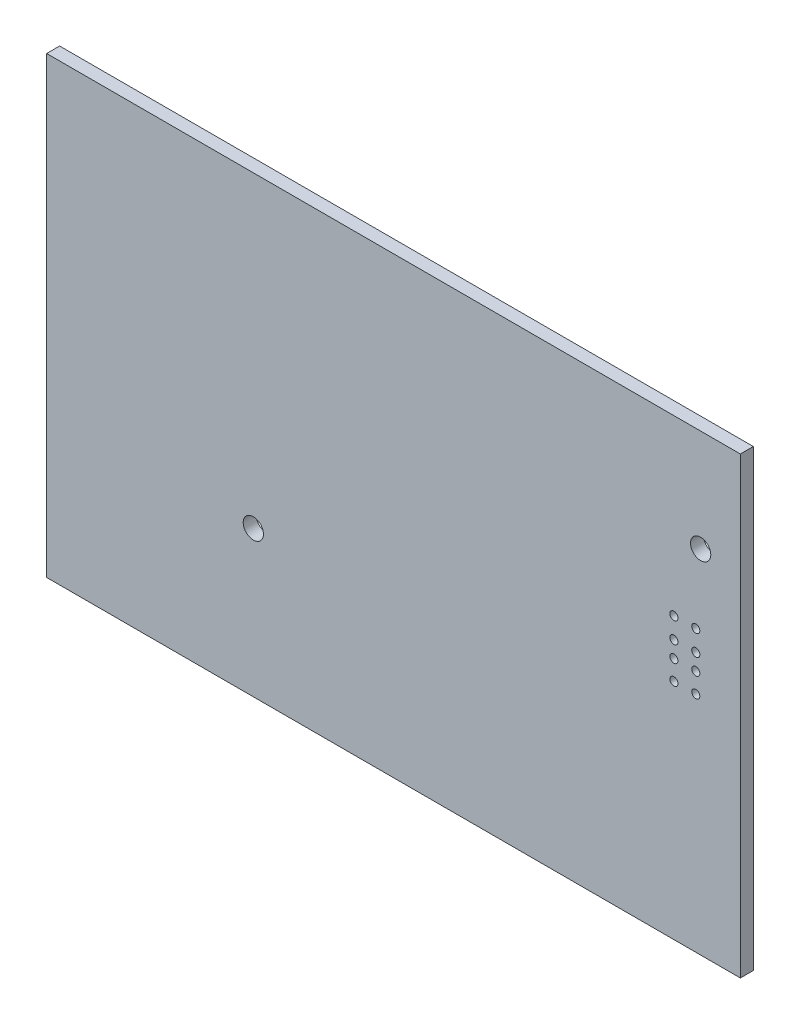
ISO-10303-21;
HEADER;
FILE_DESCRIPTION(('STEP AP214'),'2;1');
FILE_NAME('part.step','',(''),(''),'','','');
FILE_SCHEMA(('AUTOMOTIVE_DESIGN { 1 0 10303 214 1 1 1 1 }'));
ENDSEC;
DATA;
#1=APPLICATION_CONTEXT('core data for automotive mechanical design processes');
#2=APPLICATION_PROTOCOL_DEFINITION('international standard','automotive_design',2000,#1);
#3=PRODUCT_CONTEXT('',#1,'mechanical');
#4=PRODUCT('Part','Part','',(#3));
#5=PRODUCT_RELATED_PRODUCT_CATEGORY('part','',(#4));
#6=PRODUCT_DEFINITION_FORMATION('','',#4);
#7=PRODUCT_DEFINITION_CONTEXT('part definition',#1,'design');
#8=PRODUCT_DEFINITION('design','',#6,#7);
#9=PRODUCT_DEFINITION_SHAPE('','',#8);
#10=(LENGTH_UNIT() NAMED_UNIT(*) SI_UNIT(.MILLI.,.METRE.));
#11=(NAMED_UNIT(*) PLANE_ANGLE_UNIT() SI_UNIT($,.RADIAN.));
#12=(NAMED_UNIT(*) SI_UNIT($,.STERADIAN.) SOLID_ANGLE_UNIT());
#13=UNCERTAINTY_MEASURE_WITH_UNIT(LENGTH_MEASURE(1.E-05),#10,'distance_accuracy_value','');
#14=(GEOMETRIC_REPRESENTATION_CONTEXT(3) GLOBAL_UNCERTAINTY_ASSIGNED_CONTEXT((#13)) GLOBAL_UNIT_ASSIGNED_CONTEXT((#10,
#11,#12)) REPRESENTATION_CONTEXT('',''));
#15=CARTESIAN_POINT('',(0.,0.,0.));
#16=DIRECTION('',(0.,0.,1.));
#17=DIRECTION('',(1.,0.,0.));
#18=AXIS2_PLACEMENT_3D('',#15,#16,#17);
#19=CARTESIAN_POINT('',(-43.1,28.,1.6));
#20=DIRECTION('',(0.,1.,0.));
#21=DIRECTION('',(-1.,0.,0.));
#22=AXIS2_PLACEMENT_3D('',#19,#20,#21);
#23=PLANE('',#22);
#24=DIRECTION('',(1.,0.,0.));
#25=VECTOR('',#24,1.);
#26=CARTESIAN_POINT('',(-43.1,28.,0.));
#27=LINE('',#26,#25);
#28=CARTESIAN_POINT('',(-43.1,28.,0.));
#29=VERTEX_POINT('',#28);
#30=CARTESIAN_POINT('',(42.5,28.,0.));
#31=VERTEX_POINT('',#30);
#32=EDGE_CURVE('E103',#29,#31,#27,.T.);
#33=ORIENTED_EDGE('',*,*,#32,.F.);
#34=DIRECTION('',(0.,0.,-1.));
#35=VECTOR('',#34,1.);
#36=CARTESIAN_POINT('',(-43.1,28.,1.6));
#37=LINE('',#36,#35);
#38=CARTESIAN_POINT('',(-43.1,28.,1.6));
#39=VERTEX_POINT('',#38);
#40=EDGE_CURVE('E11',#39,#29,#37,.T.);
#41=ORIENTED_EDGE('',*,*,#40,.F.);
#42=DIRECTION('',(1.,0.,0.));
#43=VECTOR('',#42,1.);
#44=CARTESIAN_POINT('',(-43.1,28.,1.6));
#45=LINE('',#44,#43);
#46=CARTESIAN_POINT('',(42.5,28.,1.6));
#47=VERTEX_POINT('',#46);
#48=EDGE_CURVE('E96',#39,#47,#45,.T.);
#49=ORIENTED_EDGE('',*,*,#48,.T.);
#50=DIRECTION('',(0.,0.,-1.));
#51=VECTOR('',#50,1.);
#52=CARTESIAN_POINT('',(42.5,28.,1.6));
#53=LINE('',#52,#51);
#54=EDGE_CURVE('E79',#47,#31,#53,.T.);
#55=ORIENTED_EDGE('',*,*,#54,.T.);
#56=EDGE_LOOP('',(#33,#41,#49,#55));
#57=FACE_BOUND('',#56,.T.);
#58=ADVANCED_FACE('F36',(#57),#23,.T.);
#59=CARTESIAN_POINT('',(-43.1,-28.,1.6));
#60=DIRECTION('',(-1.,0.,0.));
#61=DIRECTION('',(0.,-1.,0.));
#62=AXIS2_PLACEMENT_3D('',#59,#60,#61);
#63=PLANE('',#62);
#64=DIRECTION('',(0.,1.,0.));
#65=VECTOR('',#64,1.);
#66=CARTESIAN_POINT('',(-43.1,-28.,0.));
#67=LINE('',#66,#65);
#68=CARTESIAN_POINT('',(-43.1,-28.,0.));
#69=VERTEX_POINT('',#68);
#70=EDGE_CURVE('E98',#69,#29,#67,.T.);
#71=ORIENTED_EDGE('',*,*,#70,.F.);
#72=DIRECTION('',(0.,0.,-1.));
#73=VECTOR('',#72,1.);
#74=CARTESIAN_POINT('',(-43.1,-28.,1.6));
#75=LINE('',#74,#73);
#76=CARTESIAN_POINT('',(-43.1,-28.,1.6));
#77=VERTEX_POINT('',#76);
#78=EDGE_CURVE('E45',#77,#69,#75,.T.);
#79=ORIENTED_EDGE('',*,*,#78,.F.);
#80=DIRECTION('',(0.,1.,0.));
#81=VECTOR('',#80,1.);
#82=CARTESIAN_POINT('',(-43.1,-28.,1.6));
#83=LINE('',#82,#81);
#84=EDGE_CURVE('E93',#77,#39,#83,.T.);
#85=ORIENTED_EDGE('',*,*,#84,.T.);
#86=ORIENTED_EDGE('',*,*,#40,.T.);
#87=EDGE_LOOP('',(#71,#79,#85,#86));
#88=FACE_BOUND('',#87,.T.);
#89=ADVANCED_FACE('F189',(#88),#63,.T.);
#90=CARTESIAN_POINT('',(42.5,-28.,1.6));
#91=DIRECTION('',(0.,-1.,0.));
#92=DIRECTION('',(0.,0.,-1.));
#93=AXIS2_PLACEMENT_3D('',#90,#91,#92);
#94=PLANE('',#93);
#95=DIRECTION('',(-1.,0.,0.));
#96=VECTOR('',#95,1.);
#97=CARTESIAN_POINT('',(42.5,-28.,0.));
#98=LINE('',#97,#96);
#99=CARTESIAN_POINT('',(42.5,-28.,0.));
#100=VERTEX_POINT('',#99);
#101=EDGE_CURVE('E87',#100,#69,#98,.T.);
#102=ORIENTED_EDGE('',*,*,#101,.F.);
#103=DIRECTION('',(0.,0.,-1.));
#104=VECTOR('',#103,1.);
#105=CARTESIAN_POINT('',(42.5,-28.,1.6));
#106=LINE('',#105,#104);
#107=CARTESIAN_POINT('',(42.5,-28.,1.6));
#108=VERTEX_POINT('',#107);
#109=EDGE_CURVE('E82',#108,#100,#106,.T.);
#110=ORIENTED_EDGE('',*,*,#109,.F.);
#111=DIRECTION('',(-1.,0.,0.));
#112=VECTOR('',#111,1.);
#113=CARTESIAN_POINT('',(42.5,-28.,1.6));
#114=LINE('',#113,#112);
#115=EDGE_CURVE('E85',#108,#77,#114,.T.);
#116=ORIENTED_EDGE('',*,*,#115,.T.);
#117=ORIENTED_EDGE('',*,*,#78,.T.);
#118=EDGE_LOOP('',(#102,#110,#116,#117));
#119=FACE_BOUND('',#118,.T.);
#120=ADVANCED_FACE('F84',(#119),#94,.T.);
#121=CARTESIAN_POINT('',(42.5,28.,1.6));
#122=DIRECTION('',(1.,0.,0.));
#123=DIRECTION('',(0.,0.,-1.));
#124=AXIS2_PLACEMENT_3D('',#121,#122,#123);
#125=PLANE('',#124);
#126=DIRECTION('',(0.,-1.,0.));
#127=VECTOR('',#126,1.);
#128=CARTESIAN_POINT('',(42.5,28.,0.));
#129=LINE('',#128,#127);
#130=EDGE_CURVE('E106',#31,#100,#129,.T.);
#131=ORIENTED_EDGE('',*,*,#130,.F.);
#132=ORIENTED_EDGE('',*,*,#54,.F.);
#133=DIRECTION('',(0.,-1.,0.));
#134=VECTOR('',#133,1.);
#135=CARTESIAN_POINT('',(42.5,28.,1.6));
#136=LINE('',#135,#134);
#137=EDGE_CURVE('E92',#47,#108,#136,.T.);
#138=ORIENTED_EDGE('',*,*,#137,.T.);
#139=ORIENTED_EDGE('',*,*,#109,.T.);
#140=EDGE_LOOP('',(#131,#132,#138,#139));
#141=FACE_BOUND('',#140,.T.);
#142=ADVANCED_FACE('F95',(#141),#125,.T.);
#143=CARTESIAN_POINT('',(0.,0.,1.6));
#144=DIRECTION('',(0.,0.,-1.));
#145=DIRECTION('',(-1.,0.,0.));
#146=AXIS2_PLACEMENT_3D('',#143,#144,#145);
#147=PLANE('',#146);
#148=CARTESIAN_POINT('',(-17.6,-10.,1.6));
#149=DIRECTION('',(0.,0.,1.));
#150=DIRECTION('',(1.,0.,0.));
#151=AXIS2_PLACEMENT_3D('',#148,#149,#150);
#152=CIRCLE('',#151,1.25);
#153=CARTESIAN_POINT('',(-16.35,-10.,1.6));
#154=VERTEX_POINT('',#153);
#155=EDGE_CURVE('E156',#154,#154,#152,.T.);
#156=ORIENTED_EDGE('',*,*,#155,.F.);
#157=EDGE_LOOP('',(#156));
#158=FACE_BOUND('',#157,.T.);
#159=CARTESIAN_POINT('',(37.6,15.4,1.6));
#160=DIRECTION('',(0.,0.,1.));
#161=DIRECTION('',(1.,0.,0.));
#162=AXIS2_PLACEMENT_3D('',#159,#160,#161);
#163=CIRCLE('',#162,1.25);
#164=CARTESIAN_POINT('',(38.85,15.4,1.6));
#165=VERTEX_POINT('',#164);
#166=EDGE_CURVE('E146',#165,#165,#163,.T.);
#167=ORIENTED_EDGE('',*,*,#166,.F.);
#168=EDGE_LOOP('',(#167));
#169=FACE_BOUND('',#168,.T.);
#170=CARTESIAN_POINT('',(37.,-0.4,1.6));
#171=DIRECTION('',(0.,0.,1.));
#172=DIRECTION('',(1.,0.,0.));
#173=AXIS2_PLACEMENT_3D('',#170,#171,#172);
#174=CIRCLE('',#173,0.499999999999999);
#175=CARTESIAN_POINT('',(37.5,-0.4,1.6));
#176=VERTEX_POINT('',#175);
#177=EDGE_CURVE('E143',#176,#176,#174,.T.);
#178=ORIENTED_EDGE('',*,*,#177,.F.);
#179=EDGE_LOOP('',(#178));
#180=FACE_BOUND('',#179,.T.);
#181=CARTESIAN_POINT('',(37.,2.04,1.6));
#182=DIRECTION('',(0.,0.,1.));
#183=DIRECTION('',(1.,0.,0.));
#184=AXIS2_PLACEMENT_3D('',#181,#182,#183);
#185=CIRCLE('',#184,0.499999999999999);
#186=CARTESIAN_POINT('',(37.5,2.04,1.6));
#187=VERTEX_POINT('',#186);
#188=EDGE_CURVE('E140',#187,#187,#185,.T.);
#189=ORIENTED_EDGE('',*,*,#188,.F.);
#190=EDGE_LOOP('',(#189));
#191=FACE_BOUND('',#190,.T.);
#192=CARTESIAN_POINT('',(37.,4.05,1.6));
#193=DIRECTION('',(0.,0.,1.));
#194=DIRECTION('',(1.,0.,0.));
#195=AXIS2_PLACEMENT_3D('',#192,#193,#194);
#196=CIRCLE('',#195,0.499999999999999);
#197=CARTESIAN_POINT('',(37.5,4.05,1.6));
#198=VERTEX_POINT('',#197);
#199=EDGE_CURVE('E136',#198,#198,#196,.T.);
#200=ORIENTED_EDGE('',*,*,#199,.F.);
#201=EDGE_LOOP('',(#200));
#202=FACE_BOUND('',#201,.T.);
#203=CARTESIAN_POINT('',(34.3,-0.4,1.6));
#204=DIRECTION('',(0.,0.,1.));
#205=DIRECTION('',(1.,0.,0.));
#206=AXIS2_PLACEMENT_3D('',#203,#204,#205);
#207=CIRCLE('',#206,0.499999999999999);
#208=CARTESIAN_POINT('',(34.8,-0.4,1.6));
#209=VERTEX_POINT('',#208);
#210=EDGE_CURVE('E132',#209,#209,#207,.T.);
#211=ORIENTED_EDGE('',*,*,#210,.F.);
#212=EDGE_LOOP('',(#211));
#213=FACE_BOUND('',#212,.T.);
#214=CARTESIAN_POINT('',(34.3,2.04,1.6));
#215=DIRECTION('',(0.,0.,1.));
#216=DIRECTION('',(1.,0.,0.));
#217=AXIS2_PLACEMENT_3D('',#214,#215,#216);
#218=CIRCLE('',#217,0.499999999999999);
#219=CARTESIAN_POINT('',(34.8,2.04,1.6));
#220=VERTEX_POINT('',#219);
#221=EDGE_CURVE('E128',#220,#220,#218,.T.);
#222=ORIENTED_EDGE('',*,*,#221,.F.);
#223=EDGE_LOOP('',(#222));
#224=FACE_BOUND('',#223,.T.);
#225=CARTESIAN_POINT('',(34.3,4.05,1.6));
#226=DIRECTION('',(0.,0.,1.));
#227=DIRECTION('',(1.,0.,0.));
#228=AXIS2_PLACEMENT_3D('',#225,#226,#227);
#229=CIRCLE('',#228,0.499999999999999);
#230=CARTESIAN_POINT('',(34.8,4.05,1.6));
#231=VERTEX_POINT('',#230);
#232=EDGE_CURVE('E124',#231,#231,#229,.T.);
#233=ORIENTED_EDGE('',*,*,#232,.F.);
#234=EDGE_LOOP('',(#233));
#235=FACE_BOUND('',#234,.T.);
#236=CARTESIAN_POINT('',(34.3,6.6,1.6));
#237=DIRECTION('',(0.,0.,1.));
#238=DIRECTION('',(1.,0.,0.));
#239=AXIS2_PLACEMENT_3D('',#236,#237,#238);
#240=CIRCLE('',#239,0.499999999999999);
#241=CARTESIAN_POINT('',(34.8,6.6,1.6));
#242=VERTEX_POINT('',#241);
#243=EDGE_CURVE('E120',#242,#242,#240,.T.);
#244=ORIENTED_EDGE('',*,*,#243,.F.);
#245=EDGE_LOOP('',(#244));
#246=FACE_BOUND('',#245,.T.);
#247=CARTESIAN_POINT('',(37.,6.6,1.6));
#248=DIRECTION('',(0.,0.,1.));
#249=DIRECTION('',(1.,0.,0.));
#250=AXIS2_PLACEMENT_3D('',#247,#248,#249);
#251=CIRCLE('',#250,0.499999999999999);
#252=CARTESIAN_POINT('',(37.5,6.6,1.6));
#253=VERTEX_POINT('',#252);
#254=EDGE_CURVE('E116',#253,#253,#251,.T.);
#255=ORIENTED_EDGE('',*,*,#254,.F.);
#256=EDGE_LOOP('',(#255));
#257=FACE_BOUND('',#256,.T.);
#258=ORIENTED_EDGE('',*,*,#48,.F.);
#259=ORIENTED_EDGE('',*,*,#84,.F.);
#260=ORIENTED_EDGE('',*,*,#115,.F.);
#261=ORIENTED_EDGE('',*,*,#137,.F.);
#262=EDGE_LOOP('',(#258,#259,#260,#261));
#263=FACE_BOUND('',#262,.T.);
#264=ADVANCED_FACE('F91',(#158,#169,#180,#191,#202,#213,#224,#235,#246,#257,#263),#147,.F.);
#265=CARTESIAN_POINT('',(0.,0.,0.));
#266=DIRECTION('',(0.,0.,-1.));
#267=DIRECTION('',(-1.,0.,0.));
#268=AXIS2_PLACEMENT_3D('',#265,#266,#267);
#269=PLANE('',#268);
#270=CARTESIAN_POINT('',(-17.6,-10.,0.));
#271=DIRECTION('',(0.,0.,-1.));
#272=DIRECTION('',(-1.,0.,0.));
#273=AXIS2_PLACEMENT_3D('',#270,#271,#272);
#274=CIRCLE('',#273,1.25);
#275=CARTESIAN_POINT('',(-18.85,-10.,0.));
#276=VERTEX_POINT('',#275);
#277=EDGE_CURVE('E39',#276,#276,#274,.T.);
#278=ORIENTED_EDGE('',*,*,#277,.F.);
#279=EDGE_LOOP('',(#278));
#280=FACE_BOUND('',#279,.T.);
#281=CARTESIAN_POINT('',(37.6,15.4,0.));
#282=DIRECTION('',(0.,0.,-1.));
#283=DIRECTION('',(-1.,0.,0.));
#284=AXIS2_PLACEMENT_3D('',#281,#282,#283);
#285=CIRCLE('',#284,1.25);
#286=CARTESIAN_POINT('',(36.35,15.4,0.));
#287=VERTEX_POINT('',#286);
#288=EDGE_CURVE('E144',#287,#287,#285,.T.);
#289=ORIENTED_EDGE('',*,*,#288,.F.);
#290=EDGE_LOOP('',(#289));
#291=FACE_BOUND('',#290,.T.);
#292=CARTESIAN_POINT('',(37.,-0.4,0.));
#293=DIRECTION('',(0.,0.,-1.));
#294=DIRECTION('',(-1.,0.,0.));
#295=AXIS2_PLACEMENT_3D('',#292,#293,#294);
#296=CIRCLE('',#295,0.499999999999999);
#297=CARTESIAN_POINT('',(36.5,-0.4,0.));
#298=VERTEX_POINT('',#297);
#299=EDGE_CURVE('E141',#298,#298,#296,.T.);
#300=ORIENTED_EDGE('',*,*,#299,.F.);
#301=EDGE_LOOP('',(#300));
#302=FACE_BOUND('',#301,.T.);
#303=CARTESIAN_POINT('',(37.,2.04,0.));
#304=DIRECTION('',(0.,0.,-1.));
#305=DIRECTION('',(-1.,0.,0.));
#306=AXIS2_PLACEMENT_3D('',#303,#304,#305);
#307=CIRCLE('',#306,0.499999999999999);
#308=CARTESIAN_POINT('',(36.5,2.04,0.));
#309=VERTEX_POINT('',#308);
#310=EDGE_CURVE('E137',#309,#309,#307,.T.);
#311=ORIENTED_EDGE('',*,*,#310,.F.);
#312=EDGE_LOOP('',(#311));
#313=FACE_BOUND('',#312,.T.);
#314=CARTESIAN_POINT('',(37.,4.05,0.));
#315=DIRECTION('',(0.,0.,-1.));
#316=DIRECTION('',(-1.,0.,0.));
#317=AXIS2_PLACEMENT_3D('',#314,#315,#316);
#318=CIRCLE('',#317,0.499999999999999);
#319=CARTESIAN_POINT('',(36.5,4.05,0.));
#320=VERTEX_POINT('',#319);
#321=EDGE_CURVE('E133',#320,#320,#318,.T.);
#322=ORIENTED_EDGE('',*,*,#321,.F.);
#323=EDGE_LOOP('',(#322));
#324=FACE_BOUND('',#323,.T.);
#325=CARTESIAN_POINT('',(34.3,-0.4,0.));
#326=DIRECTION('',(0.,0.,-1.));
#327=DIRECTION('',(-1.,0.,0.));
#328=AXIS2_PLACEMENT_3D('',#325,#326,#327);
#329=CIRCLE('',#328,0.499999999999999);
#330=CARTESIAN_POINT('',(33.8,-0.4,0.));
#331=VERTEX_POINT('',#330);
#332=EDGE_CURVE('E129',#331,#331,#329,.T.);
#333=ORIENTED_EDGE('',*,*,#332,.F.);
#334=EDGE_LOOP('',(#333));
#335=FACE_BOUND('',#334,.T.);
#336=CARTESIAN_POINT('',(34.3,2.04,0.));
#337=DIRECTION('',(0.,0.,-1.));
#338=DIRECTION('',(-1.,0.,0.));
#339=AXIS2_PLACEMENT_3D('',#336,#337,#338);
#340=CIRCLE('',#339,0.499999999999999);
#341=CARTESIAN_POINT('',(33.8,2.04,0.));
#342=VERTEX_POINT('',#341);
#343=EDGE_CURVE('E125',#342,#342,#340,.T.);
#344=ORIENTED_EDGE('',*,*,#343,.F.);
#345=EDGE_LOOP('',(#344));
#346=FACE_BOUND('',#345,.T.);
#347=CARTESIAN_POINT('',(34.3,4.05,0.));
#348=DIRECTION('',(0.,0.,-1.));
#349=DIRECTION('',(-1.,0.,0.));
#350=AXIS2_PLACEMENT_3D('',#347,#348,#349);
#351=CIRCLE('',#350,0.499999999999999);
#352=CARTESIAN_POINT('',(33.8,4.05,0.));
#353=VERTEX_POINT('',#352);
#354=EDGE_CURVE('E121',#353,#353,#351,.T.);
#355=ORIENTED_EDGE('',*,*,#354,.F.);
#356=EDGE_LOOP('',(#355));
#357=FACE_BOUND('',#356,.T.);
#358=CARTESIAN_POINT('',(34.3,6.6,0.));
#359=DIRECTION('',(0.,0.,-1.));
#360=DIRECTION('',(-1.,0.,0.));
#361=AXIS2_PLACEMENT_3D('',#358,#359,#360);
#362=CIRCLE('',#361,0.499999999999999);
#363=CARTESIAN_POINT('',(33.8,6.6,0.));
#364=VERTEX_POINT('',#363);
#365=EDGE_CURVE('E117',#364,#364,#362,.T.);
#366=ORIENTED_EDGE('',*,*,#365,.F.);
#367=EDGE_LOOP('',(#366));
#368=FACE_BOUND('',#367,.T.);
#369=CARTESIAN_POINT('',(37.,6.6,0.));
#370=DIRECTION('',(0.,0.,-1.));
#371=DIRECTION('',(-1.,0.,0.));
#372=AXIS2_PLACEMENT_3D('',#369,#370,#371);
#373=CIRCLE('',#372,0.499999999999999);
#374=CARTESIAN_POINT('',(36.5,6.6,0.));
#375=VERTEX_POINT('',#374);
#376=EDGE_CURVE('E107',#375,#375,#373,.T.);
#377=ORIENTED_EDGE('',*,*,#376,.F.);
#378=EDGE_LOOP('',(#377));
#379=FACE_BOUND('',#378,.T.);
#380=ORIENTED_EDGE('',*,*,#32,.T.);
#381=ORIENTED_EDGE('',*,*,#130,.T.);
#382=ORIENTED_EDGE('',*,*,#101,.T.);
#383=ORIENTED_EDGE('',*,*,#70,.T.);
#384=EDGE_LOOP('',(#380,#381,#382,#383));
#385=FACE_BOUND('',#384,.T.);
#386=ADVANCED_FACE('F176',(#280,#291,#302,#313,#324,#335,#346,#357,#368,#379,#385),#269,.T.);
#387=CARTESIAN_POINT('',(37.,6.6,-0.4));
#388=DIRECTION('',(0.,0.,1.));
#389=DIRECTION('',(1.,0.,0.));
#390=AXIS2_PLACEMENT_3D('',#387,#388,#389);
#391=CYLINDRICAL_SURFACE('',#390,0.499999999999999);
#392=ORIENTED_EDGE('',*,*,#376,.T.);
#393=EDGE_LOOP('',(#392));
#394=FACE_BOUND('',#393,.T.);
#395=ORIENTED_EDGE('',*,*,#254,.T.);
#396=EDGE_LOOP('',(#395));
#397=FACE_BOUND('',#396,.T.);
#398=ADVANCED_FACE('F173',(#394,#397),#391,.F.);
#399=CARTESIAN_POINT('',(34.3,6.6,-0.4));
#400=DIRECTION('',(0.,0.,1.));
#401=DIRECTION('',(1.,0.,0.));
#402=AXIS2_PLACEMENT_3D('',#399,#400,#401);
#403=CYLINDRICAL_SURFACE('',#402,0.499999999999999);
#404=ORIENTED_EDGE('',*,*,#365,.T.);
#405=EDGE_LOOP('',(#404));
#406=FACE_BOUND('',#405,.T.);
#407=ORIENTED_EDGE('',*,*,#243,.T.);
#408=EDGE_LOOP('',(#407));
#409=FACE_BOUND('',#408,.T.);
#410=ADVANCED_FACE('F215',(#406,#409),#403,.F.);
#411=CARTESIAN_POINT('',(34.3,4.05,-0.4));
#412=DIRECTION('',(0.,0.,1.));
#413=DIRECTION('',(1.,0.,0.));
#414=AXIS2_PLACEMENT_3D('',#411,#412,#413);
#415=CYLINDRICAL_SURFACE('',#414,0.499999999999999);
#416=ORIENTED_EDGE('',*,*,#354,.T.);
#417=EDGE_LOOP('',(#416));
#418=FACE_BOUND('',#417,.T.);
#419=ORIENTED_EDGE('',*,*,#232,.T.);
#420=EDGE_LOOP('',(#419));
#421=FACE_BOUND('',#420,.T.);
#422=ADVANCED_FACE('F225',(#418,#421),#415,.F.);
#423=CARTESIAN_POINT('',(34.3,2.04,-0.4));
#424=DIRECTION('',(0.,0.,1.));
#425=DIRECTION('',(1.,0.,0.));
#426=AXIS2_PLACEMENT_3D('',#423,#424,#425);
#427=CYLINDRICAL_SURFACE('',#426,0.499999999999999);
#428=ORIENTED_EDGE('',*,*,#343,.T.);
#429=EDGE_LOOP('',(#428));
#430=FACE_BOUND('',#429,.T.);
#431=ORIENTED_EDGE('',*,*,#221,.T.);
#432=EDGE_LOOP('',(#431));
#433=FACE_BOUND('',#432,.T.);
#434=ADVANCED_FACE('F235',(#430,#433),#427,.F.);
#435=CARTESIAN_POINT('',(34.3,-0.4,-0.4));
#436=DIRECTION('',(0.,0.,1.));
#437=DIRECTION('',(1.,0.,0.));
#438=AXIS2_PLACEMENT_3D('',#435,#436,#437);
#439=CYLINDRICAL_SURFACE('',#438,0.499999999999999);
#440=ORIENTED_EDGE('',*,*,#332,.T.);
#441=EDGE_LOOP('',(#440));
#442=FACE_BOUND('',#441,.T.);
#443=ORIENTED_EDGE('',*,*,#210,.T.);
#444=EDGE_LOOP('',(#443));
#445=FACE_BOUND('',#444,.T.);
#446=ADVANCED_FACE('F245',(#442,#445),#439,.F.);
#447=CARTESIAN_POINT('',(37.,4.05,-0.4));
#448=DIRECTION('',(0.,0.,1.));
#449=DIRECTION('',(1.,0.,0.));
#450=AXIS2_PLACEMENT_3D('',#447,#448,#449);
#451=CYLINDRICAL_SURFACE('',#450,0.499999999999999);
#452=ORIENTED_EDGE('',*,*,#321,.T.);
#453=EDGE_LOOP('',(#452));
#454=FACE_BOUND('',#453,.T.);
#455=ORIENTED_EDGE('',*,*,#199,.T.);
#456=EDGE_LOOP('',(#455));
#457=FACE_BOUND('',#456,.T.);
#458=ADVANCED_FACE('F255',(#454,#457),#451,.F.);
#459=CARTESIAN_POINT('',(37.,2.04,-0.4));
#460=DIRECTION('',(0.,0.,1.));
#461=DIRECTION('',(1.,0.,0.));
#462=AXIS2_PLACEMENT_3D('',#459,#460,#461);
#463=CYLINDRICAL_SURFACE('',#462,0.499999999999999);
#464=ORIENTED_EDGE('',*,*,#310,.T.);
#465=EDGE_LOOP('',(#464));
#466=FACE_BOUND('',#465,.T.);
#467=ORIENTED_EDGE('',*,*,#188,.T.);
#468=EDGE_LOOP('',(#467));
#469=FACE_BOUND('',#468,.T.);
#470=ADVANCED_FACE('F265',(#466,#469),#463,.F.);
#471=CARTESIAN_POINT('',(37.,-0.4,-0.4));
#472=DIRECTION('',(0.,0.,1.));
#473=DIRECTION('',(1.,0.,0.));
#474=AXIS2_PLACEMENT_3D('',#471,#472,#473);
#475=CYLINDRICAL_SURFACE('',#474,0.499999999999999);
#476=ORIENTED_EDGE('',*,*,#299,.T.);
#477=EDGE_LOOP('',(#476));
#478=FACE_BOUND('',#477,.T.);
#479=ORIENTED_EDGE('',*,*,#177,.T.);
#480=EDGE_LOOP('',(#479));
#481=FACE_BOUND('',#480,.T.);
#482=ADVANCED_FACE('F275',(#478,#481),#475,.F.);
#483=CARTESIAN_POINT('',(37.6,15.4,-8.4));
#484=DIRECTION('',(0.,0.,1.));
#485=DIRECTION('',(1.,0.,0.));
#486=AXIS2_PLACEMENT_3D('',#483,#484,#485);
#487=CYLINDRICAL_SURFACE('',#486,1.25);
#488=ORIENTED_EDGE('',*,*,#288,.T.);
#489=EDGE_LOOP('',(#488));
#490=FACE_BOUND('',#489,.T.);
#491=ORIENTED_EDGE('',*,*,#166,.T.);
#492=EDGE_LOOP('',(#491));
#493=FACE_BOUND('',#492,.T.);
#494=ADVANCED_FACE('F285',(#490,#493),#487,.F.);
#495=CARTESIAN_POINT('',(-17.6,-10.,-8.4));
#496=DIRECTION('',(0.,0.,1.));
#497=DIRECTION('',(1.,0.,0.));
#498=AXIS2_PLACEMENT_3D('',#495,#496,#497);
#499=CYLINDRICAL_SURFACE('',#498,1.25);
#500=ORIENTED_EDGE('',*,*,#277,.T.);
#501=EDGE_LOOP('',(#500));
#502=FACE_BOUND('',#501,.T.);
#503=ORIENTED_EDGE('',*,*,#155,.T.);
#504=EDGE_LOOP('',(#503));
#505=FACE_BOUND('',#504,.T.);
#506=ADVANCED_FACE('F304',(#502,#505),#499,.F.);
#507=CLOSED_SHELL('',(#58,#89,#120,#142,#264,#386,#398,#410,#422,#434,#446,#458,#470,#482,#494,#506));
#508=MANIFOLD_SOLID_BREP('B2',#507);
#509=ADVANCED_BREP_SHAPE_REPRESENTATION('',(#18,#508),#14);
#510=SHAPE_DEFINITION_REPRESENTATION(#9,#509);
ENDSEC;
END-ISO-10303-21;
